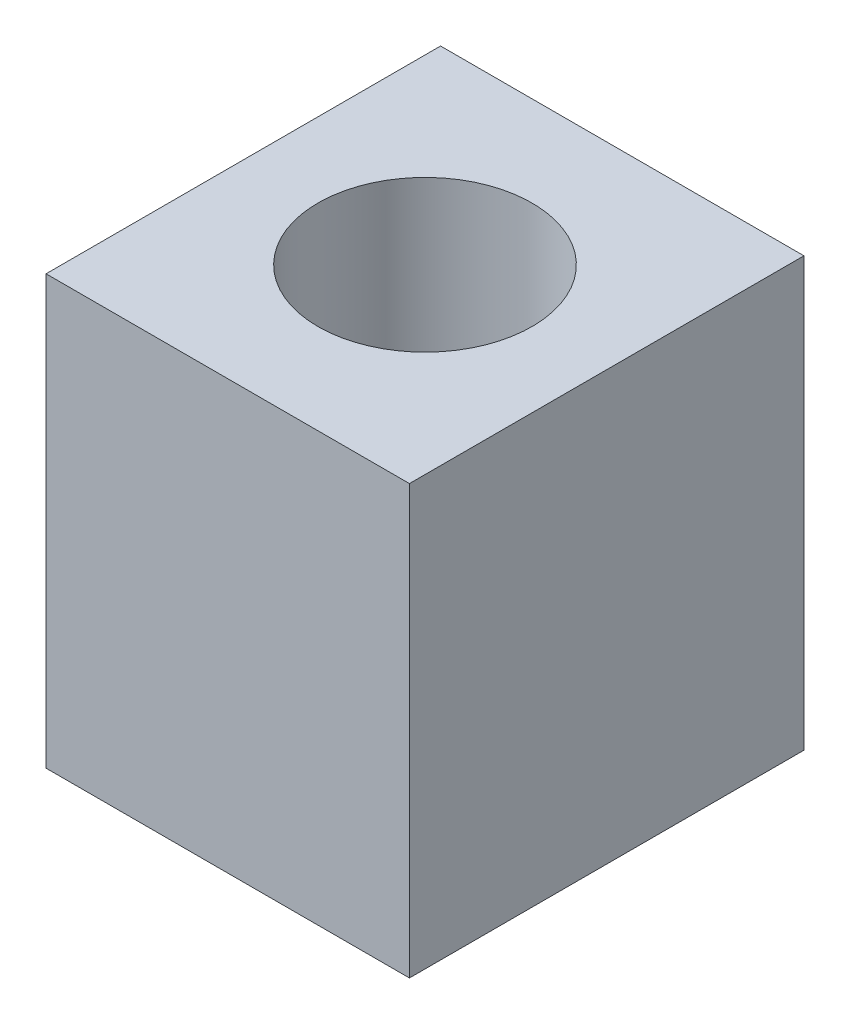
ISO-10303-21;
HEADER;
FILE_DESCRIPTION(('STEP AP214'),'2;1');
FILE_NAME('part.step','',(''),(''),'','','');
FILE_SCHEMA(('AUTOMOTIVE_DESIGN { 1 0 10303 214 1 1 1 1 }'));
ENDSEC;
DATA;
#1=APPLICATION_CONTEXT('core data for automotive mechanical design processes');
#2=APPLICATION_PROTOCOL_DEFINITION('international standard','automotive_design',2000,#1);
#3=PRODUCT_CONTEXT('',#1,'mechanical');
#4=PRODUCT('Part','Part','',(#3));
#5=PRODUCT_RELATED_PRODUCT_CATEGORY('part','',(#4));
#6=PRODUCT_DEFINITION_FORMATION('','',#4);
#7=PRODUCT_DEFINITION_CONTEXT('part definition',#1,'design');
#8=PRODUCT_DEFINITION('design','',#6,#7);
#9=PRODUCT_DEFINITION_SHAPE('','',#8);
#10=(LENGTH_UNIT() NAMED_UNIT(*) SI_UNIT(.MILLI.,.METRE.));
#11=(NAMED_UNIT(*) PLANE_ANGLE_UNIT() SI_UNIT($,.RADIAN.));
#12=(NAMED_UNIT(*) SI_UNIT($,.STERADIAN.) SOLID_ANGLE_UNIT());
#13=UNCERTAINTY_MEASURE_WITH_UNIT(LENGTH_MEASURE(1.E-05),#10,'distance_accuracy_value','');
#14=(GEOMETRIC_REPRESENTATION_CONTEXT(3) GLOBAL_UNCERTAINTY_ASSIGNED_CONTEXT((#13)) GLOBAL_UNIT_ASSIGNED_CONTEXT((#10,
#11,#12)) REPRESENTATION_CONTEXT('',''));
#15=CARTESIAN_POINT('',(0.,0.,0.));
#16=DIRECTION('',(0.,0.,1.));
#17=DIRECTION('',(1.,0.,0.));
#18=AXIS2_PLACEMENT_3D('',#15,#16,#17);
#19=CARTESIAN_POINT('',(-8.335,10.,9.135));
#20=DIRECTION('',(0.,-1.,0.));
#21=DIRECTION('',(0.,0.,-1.));
#22=AXIS2_PLACEMENT_3D('',#19,#20,#21);
#23=PLANE('',#22);
#24=CARTESIAN_POINT('',(0.,10.,0.));
#25=DIRECTION('',(0.,-1.,0.));
#26=DIRECTION('',(0.,0.,-1.));
#27=AXIS2_PLACEMENT_3D('',#24,#25,#26);
#28=CIRCLE('',#27,4.25);
#29=CARTESIAN_POINT('',(0.,10.,-4.25));
#30=VERTEX_POINT('',#29);
#31=EDGE_CURVE('E175',#30,#30,#28,.T.);
#32=ORIENTED_EDGE('',*,*,#31,.F.);
#33=EDGE_LOOP('',(#32));
#34=FACE_BOUND('',#33,.T.);
#35=DIRECTION('',(0.,0.,-1.));
#36=VECTOR('',#35,1.);
#37=CARTESIAN_POINT('',(-7.335,10.,-10.135));
#38=LINE('',#37,#36);
#39=CARTESIAN_POINT('',(-7.335,10.,8.135));
#40=VERTEX_POINT('',#39);
#41=CARTESIAN_POINT('',(-7.335,10.,1.56453667262869));
#42=VERTEX_POINT('',#41);
#43=EDGE_CURVE('E199',#40,#42,#38,.T.);
#44=ORIENTED_EDGE('',*,*,#43,.F.);
#45=DIRECTION('',(-1.,0.,0.));
#46=VECTOR('',#45,1.);
#47=CARTESIAN_POINT('',(-9.335,10.,8.135));
#48=LINE('',#47,#46);
#49=CARTESIAN_POINT('',(7.335,10.,8.135));
#50=VERTEX_POINT('',#49);
#51=EDGE_CURVE('E169',#50,#40,#48,.T.);
#52=ORIENTED_EDGE('',*,*,#51,.F.);
#53=DIRECTION('',(0.,0.,1.));
#54=VECTOR('',#53,1.);
#55=CARTESIAN_POINT('',(7.335,10.,-10.135));
#56=LINE('',#55,#54);
#57=CARTESIAN_POINT('',(7.335,10.,1.56453667262865));
#58=VERTEX_POINT('',#57);
#59=EDGE_CURVE('E202',#58,#50,#56,.T.);
#60=ORIENTED_EDGE('',*,*,#59,.F.);
#61=CARTESIAN_POINT('',(0.,10.,0.));
#62=DIRECTION('',(0.,1.,0.));
#63=DIRECTION('',(0.,0.,1.));
#64=AXIS2_PLACEMENT_3D('',#61,#62,#63);
#65=CIRCLE('',#64,7.5);
#66=EDGE_CURVE('E158',#42,#58,#65,.T.);
#67=ORIENTED_EDGE('',*,*,#66,.F.);
#68=EDGE_LOOP('',(#44,#52,#60,#67));
#69=FACE_BOUND('',#68,.T.);
#70=DIRECTION('',(-1.,0.,0.));
#71=VECTOR('',#70,1.);
#72=CARTESIAN_POINT('',(8.33500000000001,10.,9.135));
#73=LINE('',#72,#71);
#74=CARTESIAN_POINT('',(8.33500000000001,10.,9.135));
#75=VERTEX_POINT('',#74);
#76=CARTESIAN_POINT('',(-8.335,10.,9.135));
#77=VERTEX_POINT('',#76);
#78=EDGE_CURVE('E210',#75,#77,#73,.T.);
#79=ORIENTED_EDGE('',*,*,#78,.T.);
#80=DIRECTION('',(0.,0.,-1.));
#81=VECTOR('',#80,1.);
#82=CARTESIAN_POINT('',(-8.335,10.,9.135));
#83=LINE('',#82,#81);
#84=CARTESIAN_POINT('',(-8.335,10.,-9.135));
#85=VERTEX_POINT('',#84);
#86=EDGE_CURVE('E213',#77,#85,#83,.T.);
#87=ORIENTED_EDGE('',*,*,#86,.T.);
#88=DIRECTION('',(1.,0.,0.));
#89=VECTOR('',#88,1.);
#90=CARTESIAN_POINT('',(-8.335,10.,-9.135));
#91=LINE('',#90,#89);
#92=CARTESIAN_POINT('',(8.33500000000001,10.,-9.135));
#93=VERTEX_POINT('',#92);
#94=EDGE_CURVE('E217',#85,#93,#91,.T.);
#95=ORIENTED_EDGE('',*,*,#94,.T.);
#96=DIRECTION('',(0.,0.,1.));
#97=VECTOR('',#96,1.);
#98=CARTESIAN_POINT('',(8.33500000000001,10.,-9.135));
#99=LINE('',#98,#97);
#100=EDGE_CURVE('E220',#93,#75,#99,.T.);
#101=ORIENTED_EDGE('',*,*,#100,.T.);
#102=EDGE_LOOP('',(#79,#87,#95,#101));
#103=FACE_BOUND('',#102,.T.);
#104=CARTESIAN_POINT('',(-7.335,10.,-1.56453667262869));
#105=VERTEX_POINT('',#104);
#106=CARTESIAN_POINT('',(-7.335,10.,-8.135));
#107=VERTEX_POINT('',#106);
#108=EDGE_CURVE('E197',#105,#107,#38,.T.);
#109=ORIENTED_EDGE('',*,*,#108,.F.);
#110=CARTESIAN_POINT('',(0.,10.,0.));
#111=DIRECTION('',(0.,-1.,0.));
#112=DIRECTION('',(0.,0.,-1.));
#113=AXIS2_PLACEMENT_3D('',#110,#111,#112);
#114=CIRCLE('',#113,7.5);
#115=CARTESIAN_POINT('',(7.335,10.,-1.56453667262865));
#116=VERTEX_POINT('',#115);
#117=EDGE_CURVE('E206',#105,#116,#114,.T.);
#118=ORIENTED_EDGE('',*,*,#117,.T.);
#119=CARTESIAN_POINT('',(7.33500000000001,10.,-8.135));
#120=VERTEX_POINT('',#119);
#121=EDGE_CURVE('E204',#120,#116,#56,.T.);
#122=ORIENTED_EDGE('',*,*,#121,.F.);
#123=DIRECTION('',(1.,0.,0.));
#124=VECTOR('',#123,1.);
#125=CARTESIAN_POINT('',(-9.335,10.,-8.135));
#126=LINE('',#125,#124);
#127=EDGE_CURVE('E200',#107,#120,#126,.T.);
#128=ORIENTED_EDGE('',*,*,#127,.F.);
#129=EDGE_LOOP('',(#109,#118,#122,#128));
#130=FACE_BOUND('',#129,.T.);
#131=ADVANCED_FACE('F32',(#34,#69,#103,#130),#23,.T.);
#132=CARTESIAN_POINT('',(-9.335,22.,-10.135));
#133=DIRECTION('',(1.,0.,0.));
#134=DIRECTION('',(0.,0.,-1.));
#135=AXIS2_PLACEMENT_3D('',#132,#133,#134);
#136=PLANE('',#135);
#137=DIRECTION('',(0.,0.,1.));
#138=VECTOR('',#137,1.);
#139=CARTESIAN_POINT('',(-9.335,0.,-10.135));
#140=LINE('',#139,#138);
#141=CARTESIAN_POINT('',(-9.335,0.,-10.135));
#142=VERTEX_POINT('',#141);
#143=CARTESIAN_POINT('',(-9.335,0.,10.135));
#144=VERTEX_POINT('',#143);
#145=EDGE_CURVE('E245',#142,#144,#140,.T.);
#146=ORIENTED_EDGE('',*,*,#145,.T.);
#147=DIRECTION('',(0.,-1.,0.));
#148=VECTOR('',#147,1.);
#149=CARTESIAN_POINT('',(-9.335,22.,10.135));
#150=LINE('',#149,#148);
#151=CARTESIAN_POINT('',(-9.335,22.,10.135));
#152=VERTEX_POINT('',#151);
#153=EDGE_CURVE('E11',#152,#144,#150,.T.);
#154=ORIENTED_EDGE('',*,*,#153,.F.);
#155=DIRECTION('',(0.,0.,1.));
#156=VECTOR('',#155,1.);
#157=CARTESIAN_POINT('',(-9.335,22.,-10.135));
#158=LINE('',#157,#156);
#159=CARTESIAN_POINT('',(-9.335,22.,-10.135));
#160=VERTEX_POINT('',#159);
#161=EDGE_CURVE('E248',#160,#152,#158,.T.);
#162=ORIENTED_EDGE('',*,*,#161,.F.);
#163=DIRECTION('',(0.,-1.,0.));
#164=VECTOR('',#163,1.);
#165=CARTESIAN_POINT('',(-9.335,22.,-10.135));
#166=LINE('',#165,#164);
#167=EDGE_CURVE('E258',#160,#142,#166,.T.);
#168=ORIENTED_EDGE('',*,*,#167,.T.);
#169=EDGE_LOOP('',(#146,#154,#162,#168));
#170=FACE_BOUND('',#169,.T.);
#171=ADVANCED_FACE('F34',(#170),#136,.F.);
#172=CARTESIAN_POINT('',(-9.335,22.,10.135));
#173=DIRECTION('',(0.,0.,-1.));
#174=DIRECTION('',(-1.,0.,0.));
#175=AXIS2_PLACEMENT_3D('',#172,#173,#174);
#176=PLANE('',#175);
#177=DIRECTION('',(1.,0.,0.));
#178=VECTOR('',#177,1.);
#179=CARTESIAN_POINT('',(-9.335,0.,10.135));
#180=LINE('',#179,#178);
#181=CARTESIAN_POINT('',(9.335,0.,10.135));
#182=VERTEX_POINT('',#181);
#183=EDGE_CURVE('E261',#144,#182,#180,.T.);
#184=ORIENTED_EDGE('',*,*,#183,.T.);
#185=DIRECTION('',(0.,-1.,0.));
#186=VECTOR('',#185,1.);
#187=CARTESIAN_POINT('',(9.335,22.,10.135));
#188=LINE('',#187,#186);
#189=CARTESIAN_POINT('',(9.335,22.,10.135));
#190=VERTEX_POINT('',#189);
#191=EDGE_CURVE('E41',#190,#182,#188,.T.);
#192=ORIENTED_EDGE('',*,*,#191,.F.);
#193=DIRECTION('',(1.,0.,0.));
#194=VECTOR('',#193,1.);
#195=CARTESIAN_POINT('',(-9.335,22.,10.135));
#196=LINE('',#195,#194);
#197=EDGE_CURVE('E251',#152,#190,#196,.T.);
#198=ORIENTED_EDGE('',*,*,#197,.F.);
#199=ORIENTED_EDGE('',*,*,#153,.T.);
#200=EDGE_LOOP('',(#184,#192,#198,#199));
#201=FACE_BOUND('',#200,.T.);
#202=ADVANCED_FACE('F292',(#201),#176,.F.);
#203=CARTESIAN_POINT('',(9.335,22.,-10.135));
#204=DIRECTION('',(-1.,0.,0.));
#205=DIRECTION('',(0.,0.,1.));
#206=AXIS2_PLACEMENT_3D('',#203,#204,#205);
#207=PLANE('',#206);
#208=DIRECTION('',(0.,0.,-1.));
#209=VECTOR('',#208,1.);
#210=CARTESIAN_POINT('',(9.335,0.,-10.135));
#211=LINE('',#210,#209);
#212=CARTESIAN_POINT('',(9.335,0.,-10.135));
#213=VERTEX_POINT('',#212);
#214=EDGE_CURVE('E263',#182,#213,#211,.T.);
#215=ORIENTED_EDGE('',*,*,#214,.T.);
#216=DIRECTION('',(0.,-1.,0.));
#217=VECTOR('',#216,1.);
#218=CARTESIAN_POINT('',(9.335,22.,-10.135));
#219=LINE('',#218,#217);
#220=CARTESIAN_POINT('',(9.335,22.,-10.135));
#221=VERTEX_POINT('',#220);
#222=EDGE_CURVE('E268',#221,#213,#219,.T.);
#223=ORIENTED_EDGE('',*,*,#222,.F.);
#224=DIRECTION('',(0.,0.,-1.));
#225=VECTOR('',#224,1.);
#226=CARTESIAN_POINT('',(9.335,22.,-10.135));
#227=LINE('',#226,#225);
#228=EDGE_CURVE('E254',#190,#221,#227,.T.);
#229=ORIENTED_EDGE('',*,*,#228,.F.);
#230=ORIENTED_EDGE('',*,*,#191,.T.);
#231=EDGE_LOOP('',(#215,#223,#229,#230));
#232=FACE_BOUND('',#231,.T.);
#233=ADVANCED_FACE('F276',(#232),#207,.F.);
#234=CARTESIAN_POINT('',(-9.335,22.,-10.135));
#235=DIRECTION('',(0.,0.,1.));
#236=DIRECTION('',(1.,0.,0.));
#237=AXIS2_PLACEMENT_3D('',#234,#235,#236);
#238=PLANE('',#237);
#239=DIRECTION('',(-1.,0.,0.));
#240=VECTOR('',#239,1.);
#241=CARTESIAN_POINT('',(-9.335,0.,-10.135));
#242=LINE('',#241,#240);
#243=EDGE_CURVE('E252',#213,#142,#242,.T.);
#244=ORIENTED_EDGE('',*,*,#243,.T.);
#245=ORIENTED_EDGE('',*,*,#167,.F.);
#246=DIRECTION('',(-1.,0.,0.));
#247=VECTOR('',#246,1.);
#248=CARTESIAN_POINT('',(-9.335,22.,-10.135));
#249=LINE('',#248,#247);
#250=EDGE_CURVE('E256',#221,#160,#249,.T.);
#251=ORIENTED_EDGE('',*,*,#250,.F.);
#252=ORIENTED_EDGE('',*,*,#222,.T.);
#253=EDGE_LOOP('',(#244,#245,#251,#252));
#254=FACE_BOUND('',#253,.T.);
#255=ADVANCED_FACE('F285',(#254),#238,.F.);
#256=CARTESIAN_POINT('',(-9.335,22.,10.135));
#257=DIRECTION('',(0.,1.,0.));
#258=DIRECTION('',(0.,0.,1.));
#259=AXIS2_PLACEMENT_3D('',#256,#257,#258);
#260=PLANE('',#259);
#261=CARTESIAN_POINT('',(0.,22.,0.));
#262=DIRECTION('',(0.,1.,0.));
#263=DIRECTION('',(0.,0.,1.));
#264=AXIS2_PLACEMENT_3D('',#261,#262,#263);
#265=CIRCLE('',#264,5.5);
#266=CARTESIAN_POINT('',(0.,22.,5.5));
#267=VERTEX_POINT('',#266);
#268=EDGE_CURVE('E235',#267,#267,#265,.T.);
#269=ORIENTED_EDGE('',*,*,#268,.F.);
#270=EDGE_LOOP('',(#269));
#271=FACE_BOUND('',#270,.T.);
#272=ORIENTED_EDGE('',*,*,#161,.T.);
#273=ORIENTED_EDGE('',*,*,#197,.T.);
#274=ORIENTED_EDGE('',*,*,#228,.T.);
#275=ORIENTED_EDGE('',*,*,#250,.T.);
#276=EDGE_LOOP('',(#272,#273,#274,#275));
#277=FACE_BOUND('',#276,.T.);
#278=ADVANCED_FACE('F291',(#271,#277),#260,.T.);
#279=CARTESIAN_POINT('',(-9.335,0.,10.135));
#280=DIRECTION('',(0.,1.,0.));
#281=DIRECTION('',(0.,0.,1.));
#282=AXIS2_PLACEMENT_3D('',#279,#280,#281);
#283=PLANE('',#282);
#284=DIRECTION('',(0.,0.,-1.));
#285=VECTOR('',#284,1.);
#286=CARTESIAN_POINT('',(-8.335,0.,9.135));
#287=LINE('',#286,#285);
#288=CARTESIAN_POINT('',(-8.335,0.,9.135));
#289=VERTEX_POINT('',#288);
#290=CARTESIAN_POINT('',(-8.335,0.,-9.135));
#291=VERTEX_POINT('',#290);
#292=EDGE_CURVE('E225',#289,#291,#287,.T.);
#293=ORIENTED_EDGE('',*,*,#292,.F.);
#294=DIRECTION('',(-1.,0.,0.));
#295=VECTOR('',#294,1.);
#296=CARTESIAN_POINT('',(8.33500000000001,0.,9.135));
#297=LINE('',#296,#295);
#298=CARTESIAN_POINT('',(8.33500000000001,0.,9.135));
#299=VERTEX_POINT('',#298);
#300=EDGE_CURVE('E209',#299,#289,#297,.T.);
#301=ORIENTED_EDGE('',*,*,#300,.F.);
#302=DIRECTION('',(0.,0.,1.));
#303=VECTOR('',#302,1.);
#304=CARTESIAN_POINT('',(8.33500000000001,0.,-9.135));
#305=LINE('',#304,#303);
#306=CARTESIAN_POINT('',(8.33500000000001,0.,-9.135));
#307=VERTEX_POINT('',#306);
#308=EDGE_CURVE('E214',#307,#299,#305,.T.);
#309=ORIENTED_EDGE('',*,*,#308,.F.);
#310=DIRECTION('',(1.,0.,0.));
#311=VECTOR('',#310,1.);
#312=CARTESIAN_POINT('',(-8.335,0.,-9.135));
#313=LINE('',#312,#311);
#314=EDGE_CURVE('E228',#291,#307,#313,.T.);
#315=ORIENTED_EDGE('',*,*,#314,.F.);
#316=EDGE_LOOP('',(#293,#301,#309,#315));
#317=FACE_BOUND('',#316,.T.);
#318=ORIENTED_EDGE('',*,*,#145,.F.);
#319=ORIENTED_EDGE('',*,*,#243,.F.);
#320=ORIENTED_EDGE('',*,*,#214,.F.);
#321=ORIENTED_EDGE('',*,*,#183,.F.);
#322=EDGE_LOOP('',(#318,#319,#320,#321));
#323=FACE_BOUND('',#322,.T.);
#324=ADVANCED_FACE('F282',(#317,#323),#283,.F.);
#325=CARTESIAN_POINT('',(0.,12.,0.));
#326=DIRECTION('',(0.,1.,0.));
#327=DIRECTION('',(0.,0.,1.));
#328=AXIS2_PLACEMENT_3D('',#325,#326,#327);
#329=CYLINDRICAL_SURFACE('',#328,5.5);
#330=CARTESIAN_POINT('',(0.,12.,0.));
#331=DIRECTION('',(0.,1.,0.));
#332=DIRECTION('',(0.,0.,1.));
#333=AXIS2_PLACEMENT_3D('',#330,#331,#332);
#334=CIRCLE('',#333,5.5);
#335=CARTESIAN_POINT('',(0.,12.,5.5));
#336=VERTEX_POINT('',#335);
#337=EDGE_CURVE('E242',#336,#336,#334,.T.);
#338=ORIENTED_EDGE('',*,*,#337,.F.);
#339=EDGE_LOOP('',(#338));
#340=FACE_BOUND('',#339,.T.);
#341=ORIENTED_EDGE('',*,*,#268,.T.);
#342=EDGE_LOOP('',(#341));
#343=FACE_BOUND('',#342,.T.);
#344=ADVANCED_FACE('F329',(#340,#343),#329,.F.);
#345=CARTESIAN_POINT('',(0.,12.,0.));
#346=DIRECTION('',(0.,1.,0.));
#347=DIRECTION('',(0.,0.,1.));
#348=AXIS2_PLACEMENT_3D('',#345,#346,#347);
#349=PLANE('',#348);
#350=CARTESIAN_POINT('',(0.,12.,0.));
#351=DIRECTION('',(0.,1.,0.));
#352=DIRECTION('',(0.,0.,1.));
#353=AXIS2_PLACEMENT_3D('',#350,#351,#352);
#354=CIRCLE('',#353,4.25);
#355=CARTESIAN_POINT('',(0.,12.,4.25));
#356=VERTEX_POINT('',#355);
#357=EDGE_CURVE('E36',#356,#356,#354,.T.);
#358=ORIENTED_EDGE('',*,*,#357,.F.);
#359=EDGE_LOOP('',(#358));
#360=FACE_BOUND('',#359,.T.);
#361=ORIENTED_EDGE('',*,*,#337,.T.);
#362=EDGE_LOOP('',(#361));
#363=FACE_BOUND('',#362,.T.);
#364=ADVANCED_FACE('F325',(#360,#363),#349,.T.);
#365=CARTESIAN_POINT('',(8.33500000000001,10.,9.135));
#366=DIRECTION('',(0.,0.,1.));
#367=DIRECTION('',(1.,0.,0.));
#368=AXIS2_PLACEMENT_3D('',#365,#366,#367);
#369=PLANE('',#368);
#370=ORIENTED_EDGE('',*,*,#300,.T.);
#371=DIRECTION('',(0.,-1.,0.));
#372=VECTOR('',#371,1.);
#373=CARTESIAN_POINT('',(-8.335,10.,9.135));
#374=LINE('',#373,#372);
#375=EDGE_CURVE('E223',#77,#289,#374,.T.);
#376=ORIENTED_EDGE('',*,*,#375,.F.);
#377=ORIENTED_EDGE('',*,*,#78,.F.);
#378=DIRECTION('',(0.,-1.,0.));
#379=VECTOR('',#378,1.);
#380=CARTESIAN_POINT('',(8.33500000000001,10.,9.135));
#381=LINE('',#380,#379);
#382=EDGE_CURVE('E233',#75,#299,#381,.T.);
#383=ORIENTED_EDGE('',*,*,#382,.T.);
#384=EDGE_LOOP('',(#370,#376,#377,#383));
#385=FACE_BOUND('',#384,.T.);
#386=ADVANCED_FACE('F314',(#385),#369,.F.);
#387=CARTESIAN_POINT('',(8.33500000000001,10.,-9.135));
#388=DIRECTION('',(1.,0.,0.));
#389=DIRECTION('',(0.,0.,-1.));
#390=AXIS2_PLACEMENT_3D('',#387,#388,#389);
#391=PLANE('',#390);
#392=ORIENTED_EDGE('',*,*,#308,.T.);
#393=ORIENTED_EDGE('',*,*,#382,.F.);
#394=ORIENTED_EDGE('',*,*,#100,.F.);
#395=DIRECTION('',(0.,-1.,0.));
#396=VECTOR('',#395,1.);
#397=CARTESIAN_POINT('',(8.33500000000001,10.,-9.135));
#398=LINE('',#397,#396);
#399=EDGE_CURVE('E236',#93,#307,#398,.T.);
#400=ORIENTED_EDGE('',*,*,#399,.T.);
#401=EDGE_LOOP('',(#392,#393,#394,#400));
#402=FACE_BOUND('',#401,.T.);
#403=ADVANCED_FACE('F310',(#402),#391,.F.);
#404=CARTESIAN_POINT('',(-8.335,10.,-9.135));
#405=DIRECTION('',(0.,0.,-1.));
#406=DIRECTION('',(-1.,0.,0.));
#407=AXIS2_PLACEMENT_3D('',#404,#405,#406);
#408=PLANE('',#407);
#409=ORIENTED_EDGE('',*,*,#314,.T.);
#410=ORIENTED_EDGE('',*,*,#399,.F.);
#411=ORIENTED_EDGE('',*,*,#94,.F.);
#412=DIRECTION('',(0.,-1.,0.));
#413=VECTOR('',#412,1.);
#414=CARTESIAN_POINT('',(-8.335,10.,-9.135));
#415=LINE('',#414,#413);
#416=EDGE_CURVE('E238',#85,#291,#415,.T.);
#417=ORIENTED_EDGE('',*,*,#416,.T.);
#418=EDGE_LOOP('',(#409,#410,#411,#417));
#419=FACE_BOUND('',#418,.T.);
#420=ADVANCED_FACE('F313',(#419),#408,.F.);
#421=CARTESIAN_POINT('',(-8.335,10.,9.135));
#422=DIRECTION('',(-1.,0.,0.));
#423=DIRECTION('',(0.,0.,1.));
#424=AXIS2_PLACEMENT_3D('',#421,#422,#423);
#425=PLANE('',#424);
#426=ORIENTED_EDGE('',*,*,#292,.T.);
#427=ORIENTED_EDGE('',*,*,#416,.F.);
#428=ORIENTED_EDGE('',*,*,#86,.F.);
#429=ORIENTED_EDGE('',*,*,#375,.T.);
#430=EDGE_LOOP('',(#426,#427,#428,#429));
#431=FACE_BOUND('',#430,.T.);
#432=ADVANCED_FACE('F318',(#431),#425,.F.);
#433=CARTESIAN_POINT('',(0.,12.,0.));
#434=DIRECTION('',(0.,1.,0.));
#435=DIRECTION('',(0.,0.,1.));
#436=AXIS2_PLACEMENT_3D('',#433,#434,#435);
#437=CYLINDRICAL_SURFACE('',#436,7.5);
#438=DIRECTION('',(0.,1.,0.));
#439=VECTOR('',#438,1.);
#440=CARTESIAN_POINT('',(7.335,12.,-1.56453667262865));
#441=LINE('',#440,#439);
#442=CARTESIAN_POINT('',(7.335,20.,-1.56453667262865));
#443=VERTEX_POINT('',#442);
#444=EDGE_CURVE('E191',#443,#116,#441,.F.);
#445=ORIENTED_EDGE('',*,*,#444,.T.);
#446=ORIENTED_EDGE('',*,*,#117,.F.);
#447=DIRECTION('',(0.,1.,0.));
#448=VECTOR('',#447,1.);
#449=CARTESIAN_POINT('',(-7.335,12.,-1.56453667262869));
#450=LINE('',#449,#448);
#451=CARTESIAN_POINT('',(-7.335,20.,-1.56453667262869));
#452=VERTEX_POINT('',#451);
#453=EDGE_CURVE('E171',#452,#105,#450,.F.);
#454=ORIENTED_EDGE('',*,*,#453,.F.);
#455=CARTESIAN_POINT('',(0.,20.,0.));
#456=DIRECTION('',(0.,1.,0.));
#457=DIRECTION('',(0.,0.,1.));
#458=AXIS2_PLACEMENT_3D('',#455,#456,#457);
#459=CIRCLE('',#458,7.5);
#460=EDGE_CURVE('E187',#443,#452,#459,.T.);
#461=ORIENTED_EDGE('',*,*,#460,.F.);
#462=EDGE_LOOP('',(#445,#446,#454,#461));
#463=FACE_BOUND('',#462,.T.);
#464=ADVANCED_FACE('F308',(#463),#437,.T.);
#465=CARTESIAN_POINT('',(-9.335,20.,10.135));
#466=DIRECTION('',(0.,1.,0.));
#467=DIRECTION('',(0.,0.,1.));
#468=AXIS2_PLACEMENT_3D('',#465,#466,#467);
#469=PLANE('',#468);
#470=DIRECTION('',(0.,0.,1.));
#471=VECTOR('',#470,1.);
#472=CARTESIAN_POINT('',(-7.335,20.,-10.135));
#473=LINE('',#472,#471);
#474=CARTESIAN_POINT('',(-7.335,20.,-8.135));
#475=VERTEX_POINT('',#474);
#476=EDGE_CURVE('E157',#475,#452,#473,.T.);
#477=ORIENTED_EDGE('',*,*,#476,.F.);
#478=DIRECTION('',(-1.,0.,0.));
#479=VECTOR('',#478,1.);
#480=CARTESIAN_POINT('',(-9.335,20.,-8.135));
#481=LINE('',#480,#479);
#482=CARTESIAN_POINT('',(7.335,20.,-8.135));
#483=VERTEX_POINT('',#482);
#484=EDGE_CURVE('E180',#483,#475,#481,.T.);
#485=ORIENTED_EDGE('',*,*,#484,.F.);
#486=DIRECTION('',(0.,0.,-1.));
#487=VECTOR('',#486,1.);
#488=CARTESIAN_POINT('',(7.335,20.,-10.135));
#489=LINE('',#488,#487);
#490=EDGE_CURVE('E165',#443,#483,#489,.T.);
#491=ORIENTED_EDGE('',*,*,#490,.F.);
#492=ORIENTED_EDGE('',*,*,#460,.T.);
#493=EDGE_LOOP('',(#477,#485,#491,#492));
#494=FACE_BOUND('',#493,.T.);
#495=ADVANCED_FACE('F384',(#494),#469,.F.);
#496=CARTESIAN_POINT('',(-9.335,22.,-8.135));
#497=DIRECTION('',(0.,0.,1.));
#498=DIRECTION('',(1.,0.,0.));
#499=AXIS2_PLACEMENT_3D('',#496,#497,#498);
#500=PLANE('',#499);
#501=ORIENTED_EDGE('',*,*,#127,.T.);
#502=DIRECTION('',(0.,-1.,0.));
#503=VECTOR('',#502,1.);
#504=CARTESIAN_POINT('',(7.33500000000001,22.,-8.135));
#505=LINE('',#504,#503);
#506=EDGE_CURVE('E56',#483,#120,#505,.T.);
#507=ORIENTED_EDGE('',*,*,#506,.F.);
#508=ORIENTED_EDGE('',*,*,#484,.T.);
#509=DIRECTION('',(0.,-1.,0.));
#510=VECTOR('',#509,1.);
#511=CARTESIAN_POINT('',(-7.335,22.,-8.135));
#512=LINE('',#511,#510);
#513=EDGE_CURVE('E178',#475,#107,#512,.T.);
#514=ORIENTED_EDGE('',*,*,#513,.T.);
#515=EDGE_LOOP('',(#501,#507,#508,#514));
#516=FACE_BOUND('',#515,.T.);
#517=ADVANCED_FACE('F392',(#516),#500,.T.);
#518=CARTESIAN_POINT('',(-7.335,22.,-10.135));
#519=DIRECTION('',(1.,0.,0.));
#520=DIRECTION('',(0.,0.,-1.));
#521=AXIS2_PLACEMENT_3D('',#518,#519,#520);
#522=PLANE('',#521);
#523=ORIENTED_EDGE('',*,*,#108,.T.);
#524=ORIENTED_EDGE('',*,*,#513,.F.);
#525=ORIENTED_EDGE('',*,*,#476,.T.);
#526=ORIENTED_EDGE('',*,*,#453,.T.);
#527=EDGE_LOOP('',(#523,#524,#525,#526));
#528=FACE_BOUND('',#527,.T.);
#529=ADVANCED_FACE('F399',(#528),#522,.T.);
#530=CARTESIAN_POINT('',(7.335,22.,-10.135));
#531=DIRECTION('',(-1.,0.,0.));
#532=DIRECTION('',(0.,0.,1.));
#533=AXIS2_PLACEMENT_3D('',#530,#531,#532);
#534=PLANE('',#533);
#535=ORIENTED_EDGE('',*,*,#121,.T.);
#536=ORIENTED_EDGE('',*,*,#444,.F.);
#537=ORIENTED_EDGE('',*,*,#490,.T.);
#538=ORIENTED_EDGE('',*,*,#506,.T.);
#539=EDGE_LOOP('',(#535,#536,#537,#538));
#540=FACE_BOUND('',#539,.T.);
#541=ADVANCED_FACE('F407',(#540),#534,.T.);
#542=ORIENTED_EDGE('',*,*,#43,.T.);
#543=DIRECTION('',(0.,1.,0.));
#544=VECTOR('',#543,1.);
#545=CARTESIAN_POINT('',(-7.335,12.,1.56453667262869));
#546=LINE('',#545,#544);
#547=CARTESIAN_POINT('',(-7.335,20.,1.56453667262869));
#548=VERTEX_POINT('',#547);
#549=EDGE_CURVE('E153',#548,#42,#546,.F.);
#550=ORIENTED_EDGE('',*,*,#549,.F.);
#551=CARTESIAN_POINT('',(-7.335,20.,8.135));
#552=VERTEX_POINT('',#551);
#553=EDGE_CURVE('E146',#548,#552,#473,.T.);
#554=ORIENTED_EDGE('',*,*,#553,.T.);
#555=DIRECTION('',(0.,-1.,0.));
#556=VECTOR('',#555,1.);
#557=CARTESIAN_POINT('',(-7.335,22.,8.135));
#558=LINE('',#557,#556);
#559=EDGE_CURVE('E150',#552,#40,#558,.T.);
#560=ORIENTED_EDGE('',*,*,#559,.T.);
#561=EDGE_LOOP('',(#542,#550,#554,#560));
#562=FACE_BOUND('',#561,.T.);
#563=ADVANCED_FACE('F148',(#562),#522,.T.);
#564=ORIENTED_EDGE('',*,*,#59,.T.);
#565=DIRECTION('',(0.,-1.,0.));
#566=VECTOR('',#565,1.);
#567=CARTESIAN_POINT('',(7.335,22.,8.135));
#568=LINE('',#567,#566);
#569=CARTESIAN_POINT('',(7.335,20.,8.135));
#570=VERTEX_POINT('',#569);
#571=EDGE_CURVE('E48',#570,#50,#568,.T.);
#572=ORIENTED_EDGE('',*,*,#571,.F.);
#573=CARTESIAN_POINT('',(7.335,20.,1.56453667262865));
#574=VERTEX_POINT('',#573);
#575=EDGE_CURVE('E164',#570,#574,#489,.T.);
#576=ORIENTED_EDGE('',*,*,#575,.T.);
#577=DIRECTION('',(0.,1.,0.));
#578=VECTOR('',#577,1.);
#579=CARTESIAN_POINT('',(7.335,12.,1.56453667262865));
#580=LINE('',#579,#578);
#581=EDGE_CURVE('E194',#574,#58,#580,.F.);
#582=ORIENTED_EDGE('',*,*,#581,.T.);
#583=EDGE_LOOP('',(#564,#572,#576,#582));
#584=FACE_BOUND('',#583,.T.);
#585=ADVANCED_FACE('F416',(#584),#534,.T.);
#586=EDGE_CURVE('E185',#548,#574,#459,.T.);
#587=ORIENTED_EDGE('',*,*,#586,.F.);
#588=ORIENTED_EDGE('',*,*,#549,.T.);
#589=ORIENTED_EDGE('',*,*,#66,.T.);
#590=ORIENTED_EDGE('',*,*,#581,.F.);
#591=EDGE_LOOP('',(#587,#588,#589,#590));
#592=FACE_BOUND('',#591,.T.);
#593=ADVANCED_FACE('F386',(#592),#437,.T.);
#594=ORIENTED_EDGE('',*,*,#586,.T.);
#595=ORIENTED_EDGE('',*,*,#575,.F.);
#596=DIRECTION('',(1.,0.,0.));
#597=VECTOR('',#596,1.);
#598=CARTESIAN_POINT('',(-9.335,20.,8.135));
#599=LINE('',#598,#597);
#600=EDGE_CURVE('E161',#552,#570,#599,.T.);
#601=ORIENTED_EDGE('',*,*,#600,.F.);
#602=ORIENTED_EDGE('',*,*,#553,.F.);
#603=EDGE_LOOP('',(#594,#595,#601,#602));
#604=FACE_BOUND('',#603,.T.);
#605=ADVANCED_FACE('F162',(#604),#469,.F.);
#606=CARTESIAN_POINT('',(-9.335,22.,8.135));
#607=DIRECTION('',(0.,0.,-1.));
#608=DIRECTION('',(-1.,0.,0.));
#609=AXIS2_PLACEMENT_3D('',#606,#607,#608);
#610=PLANE('',#609);
#611=ORIENTED_EDGE('',*,*,#51,.T.);
#612=ORIENTED_EDGE('',*,*,#559,.F.);
#613=ORIENTED_EDGE('',*,*,#600,.T.);
#614=ORIENTED_EDGE('',*,*,#571,.T.);
#615=EDGE_LOOP('',(#611,#612,#613,#614));
#616=FACE_BOUND('',#615,.T.);
#617=ADVANCED_FACE('F167',(#616),#610,.T.);
#618=CARTESIAN_POINT('',(0.,22.,0.));
#619=DIRECTION('',(0.,-1.,0.));
#620=DIRECTION('',(0.,0.,-1.));
#621=AXIS2_PLACEMENT_3D('',#618,#619,#620);
#622=CYLINDRICAL_SURFACE('',#621,4.25);
#623=ORIENTED_EDGE('',*,*,#357,.T.);
#624=EDGE_LOOP('',(#623));
#625=FACE_BOUND('',#624,.T.);
#626=ORIENTED_EDGE('',*,*,#31,.T.);
#627=EDGE_LOOP('',(#626));
#628=FACE_BOUND('',#627,.T.);
#629=ADVANCED_FACE('F444',(#625,#628),#622,.F.);
#630=CLOSED_SHELL('',(#131,#171,#202,#233,#255,#278,#324,#344,#364,#386,#403,#420,#432,#464,
#495,#517,#529,#541,#563,#585,#593,#605,#617,#629));
#631=MANIFOLD_SOLID_BREP('B2',#630);
#632=ADVANCED_BREP_SHAPE_REPRESENTATION('',(#18,#631),#14);
#633=SHAPE_DEFINITION_REPRESENTATION(#9,#632);
ENDSEC;
END-ISO-10303-21;
